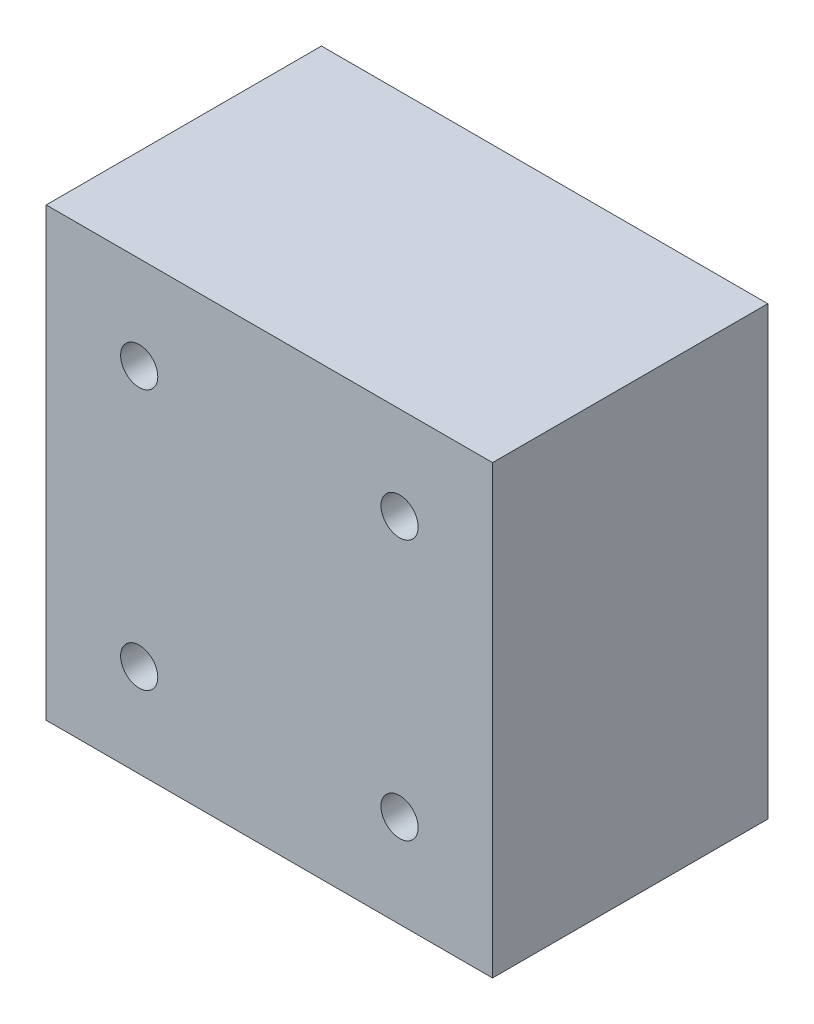
ISO-10303-21;
HEADER;
FILE_DESCRIPTION(('STEP AP214'),'2;1');
FILE_NAME('part.step','',(''),(''),'','','');
FILE_SCHEMA(('AUTOMOTIVE_DESIGN { 1 0 10303 214 1 1 1 1 }'));
ENDSEC;
DATA;
#1=APPLICATION_CONTEXT('core data for automotive mechanical design processes');
#2=APPLICATION_PROTOCOL_DEFINITION('international standard','automotive_design',2000,#1);
#3=PRODUCT_CONTEXT('',#1,'mechanical');
#4=PRODUCT('Part','Part','',(#3));
#5=PRODUCT_RELATED_PRODUCT_CATEGORY('part','',(#4));
#6=PRODUCT_DEFINITION_FORMATION('','',#4);
#7=PRODUCT_DEFINITION_CONTEXT('part definition',#1,'design');
#8=PRODUCT_DEFINITION('design','',#6,#7);
#9=PRODUCT_DEFINITION_SHAPE('','',#8);
#10=(LENGTH_UNIT() NAMED_UNIT(*) SI_UNIT(.MILLI.,.METRE.));
#11=(NAMED_UNIT(*) PLANE_ANGLE_UNIT() SI_UNIT($,.RADIAN.));
#12=(NAMED_UNIT(*) SI_UNIT($,.STERADIAN.) SOLID_ANGLE_UNIT());
#13=UNCERTAINTY_MEASURE_WITH_UNIT(LENGTH_MEASURE(1.E-05),#10,'distance_accuracy_value','');
#14=(GEOMETRIC_REPRESENTATION_CONTEXT(3) GLOBAL_UNCERTAINTY_ASSIGNED_CONTEXT((#13)) GLOBAL_UNIT_ASSIGNED_CONTEXT((#10,
#11,#12)) REPRESENTATION_CONTEXT('',''));
#15=CARTESIAN_POINT('',(0.,0.,0.));
#16=DIRECTION('',(0.,0.,1.));
#17=DIRECTION('',(1.,0.,0.));
#18=AXIS2_PLACEMENT_3D('',#15,#16,#17);
#19=CARTESIAN_POINT('',(30.,30.,37.));
#20=DIRECTION('',(-1.,0.,0.));
#21=DIRECTION('',(0.,-1.,0.));
#22=AXIS2_PLACEMENT_3D('',#19,#20,#21);
#23=PLANE('',#22);
#24=DIRECTION('',(0.,1.,0.));
#25=VECTOR('',#24,1.);
#26=CARTESIAN_POINT('',(30.,30.,0.));
#27=LINE('',#26,#25);
#28=CARTESIAN_POINT('',(30.,-30.,0.));
#29=VERTEX_POINT('',#28);
#30=CARTESIAN_POINT('',(30.,30.,0.));
#31=VERTEX_POINT('',#30);
#32=EDGE_CURVE('E113',#29,#31,#27,.T.);
#33=ORIENTED_EDGE('',*,*,#32,.T.);
#34=DIRECTION('',(0.,0.,-1.));
#35=VECTOR('',#34,1.);
#36=CARTESIAN_POINT('',(30.,30.,37.));
#37=LINE('',#36,#35);
#38=CARTESIAN_POINT('',(30.,30.,37.));
#39=VERTEX_POINT('',#38);
#40=EDGE_CURVE('E11',#39,#31,#37,.T.);
#41=ORIENTED_EDGE('',*,*,#40,.F.);
#42=DIRECTION('',(0.,1.,0.));
#43=VECTOR('',#42,1.);
#44=CARTESIAN_POINT('',(30.,30.,37.));
#45=LINE('',#44,#43);
#46=CARTESIAN_POINT('',(30.,-30.,37.));
#47=VERTEX_POINT('',#46);
#48=EDGE_CURVE('E96',#47,#39,#45,.T.);
#49=ORIENTED_EDGE('',*,*,#48,.F.);
#50=DIRECTION('',(0.,0.,-1.));
#51=VECTOR('',#50,1.);
#52=CARTESIAN_POINT('',(30.,-30.,37.));
#53=LINE('',#52,#51);
#54=EDGE_CURVE('E109',#47,#29,#53,.T.);
#55=ORIENTED_EDGE('',*,*,#54,.T.);
#56=EDGE_LOOP('',(#33,#41,#49,#55));
#57=FACE_BOUND('',#56,.T.);
#58=ADVANCED_FACE('F42',(#57),#23,.F.);
#59=CARTESIAN_POINT('',(-30.,30.,37.));
#60=DIRECTION('',(0.,-1.,0.));
#61=DIRECTION('',(0.,0.,-1.));
#62=AXIS2_PLACEMENT_3D('',#59,#60,#61);
#63=PLANE('',#62);
#64=DIRECTION('',(-1.,0.,0.));
#65=VECTOR('',#64,1.);
#66=CARTESIAN_POINT('',(-30.,30.,0.));
#67=LINE('',#66,#65);
#68=CARTESIAN_POINT('',(-30.,30.,0.));
#69=VERTEX_POINT('',#68);
#70=EDGE_CURVE('E101',#31,#69,#67,.T.);
#71=ORIENTED_EDGE('',*,*,#70,.T.);
#72=DIRECTION('',(0.,0.,-1.));
#73=VECTOR('',#72,1.);
#74=CARTESIAN_POINT('',(-30.,30.,37.));
#75=LINE('',#74,#73);
#76=CARTESIAN_POINT('',(-30.,30.,37.));
#77=VERTEX_POINT('',#76);
#78=EDGE_CURVE('E52',#77,#69,#75,.T.);
#79=ORIENTED_EDGE('',*,*,#78,.F.);
#80=DIRECTION('',(-1.,0.,0.));
#81=VECTOR('',#80,1.);
#82=CARTESIAN_POINT('',(-30.,30.,37.));
#83=LINE('',#82,#81);
#84=EDGE_CURVE('E91',#39,#77,#83,.T.);
#85=ORIENTED_EDGE('',*,*,#84,.F.);
#86=ORIENTED_EDGE('',*,*,#40,.T.);
#87=EDGE_LOOP('',(#71,#79,#85,#86));
#88=FACE_BOUND('',#87,.T.);
#89=ADVANCED_FACE('F100',(#88),#63,.F.);
#90=CARTESIAN_POINT('',(-30.,30.,37.));
#91=DIRECTION('',(1.,0.,0.));
#92=DIRECTION('',(0.,1.,0.));
#93=AXIS2_PLACEMENT_3D('',#90,#91,#92);
#94=PLANE('',#93);
#95=DIRECTION('',(0.,-1.,0.));
#96=VECTOR('',#95,1.);
#97=CARTESIAN_POINT('',(-30.,30.,0.));
#98=LINE('',#97,#96);
#99=CARTESIAN_POINT('',(-30.,-30.,0.));
#100=VERTEX_POINT('',#99);
#101=EDGE_CURVE('E78',#69,#100,#98,.T.);
#102=ORIENTED_EDGE('',*,*,#101,.T.);
#103=DIRECTION('',(0.,0.,-1.));
#104=VECTOR('',#103,1.);
#105=CARTESIAN_POINT('',(-30.,-30.,37.));
#106=LINE('',#105,#104);
#107=CARTESIAN_POINT('',(-30.,-30.,37.));
#108=VERTEX_POINT('',#107);
#109=EDGE_CURVE('E103',#108,#100,#106,.T.);
#110=ORIENTED_EDGE('',*,*,#109,.F.);
#111=DIRECTION('',(0.,-1.,0.));
#112=VECTOR('',#111,1.);
#113=CARTESIAN_POINT('',(-30.,30.,37.));
#114=LINE('',#113,#112);
#115=EDGE_CURVE('E94',#77,#108,#114,.T.);
#116=ORIENTED_EDGE('',*,*,#115,.F.);
#117=ORIENTED_EDGE('',*,*,#78,.T.);
#118=EDGE_LOOP('',(#102,#110,#116,#117));
#119=FACE_BOUND('',#118,.T.);
#120=ADVANCED_FACE('F105',(#119),#94,.F.);
#121=CARTESIAN_POINT('',(-30.,-30.,37.));
#122=DIRECTION('',(0.,1.,0.));
#123=DIRECTION('',(0.,0.,1.));
#124=AXIS2_PLACEMENT_3D('',#121,#122,#123);
#125=PLANE('',#124);
#126=DIRECTION('',(1.,0.,0.));
#127=VECTOR('',#126,1.);
#128=CARTESIAN_POINT('',(-30.,-30.,0.));
#129=LINE('',#128,#127);
#130=EDGE_CURVE('E84',#100,#29,#129,.T.);
#131=ORIENTED_EDGE('',*,*,#130,.T.);
#132=ORIENTED_EDGE('',*,*,#54,.F.);
#133=DIRECTION('',(1.,0.,0.));
#134=VECTOR('',#133,1.);
#135=CARTESIAN_POINT('',(-30.,-30.,37.));
#136=LINE('',#135,#134);
#137=EDGE_CURVE('E61',#108,#47,#136,.T.);
#138=ORIENTED_EDGE('',*,*,#137,.F.);
#139=ORIENTED_EDGE('',*,*,#109,.T.);
#140=EDGE_LOOP('',(#131,#132,#138,#139));
#141=FACE_BOUND('',#140,.T.);
#142=ADVANCED_FACE('F174',(#141),#125,.F.);
#143=CARTESIAN_POINT('',(0.,0.,37.));
#144=DIRECTION('',(0.,0.,1.));
#145=DIRECTION('',(1.,0.,0.));
#146=AXIS2_PLACEMENT_3D('',#143,#144,#145);
#147=PLANE('',#146);
#148=CARTESIAN_POINT('',(-17.5,-17.5,37.));
#149=DIRECTION('',(0.,0.,1.));
#150=DIRECTION('',(1.,0.,0.));
#151=AXIS2_PLACEMENT_3D('',#148,#149,#150);
#152=CIRCLE('',#151,2.5);
#153=CARTESIAN_POINT('',(-15.,-17.5,37.));
#154=VERTEX_POINT('',#153);
#155=EDGE_CURVE('E276',#154,#154,#152,.T.);
#156=ORIENTED_EDGE('',*,*,#155,.F.);
#157=EDGE_LOOP('',(#156));
#158=FACE_BOUND('',#157,.T.);
#159=CARTESIAN_POINT('',(17.5,-17.5,37.));
#160=DIRECTION('',(0.,0.,1.));
#161=DIRECTION('',(1.,0.,0.));
#162=AXIS2_PLACEMENT_3D('',#159,#160,#161);
#163=CIRCLE('',#162,2.5);
#164=CARTESIAN_POINT('',(20.,-17.5,37.));
#165=VERTEX_POINT('',#164);
#166=EDGE_CURVE('E269',#165,#165,#163,.T.);
#167=ORIENTED_EDGE('',*,*,#166,.F.);
#168=EDGE_LOOP('',(#167));
#169=FACE_BOUND('',#168,.T.);
#170=CARTESIAN_POINT('',(17.5,17.5,37.));
#171=DIRECTION('',(0.,0.,1.));
#172=DIRECTION('',(1.,0.,0.));
#173=AXIS2_PLACEMENT_3D('',#170,#171,#172);
#174=CIRCLE('',#173,2.5);
#175=CARTESIAN_POINT('',(20.,17.5,37.));
#176=VERTEX_POINT('',#175);
#177=EDGE_CURVE('E261',#176,#176,#174,.T.);
#178=ORIENTED_EDGE('',*,*,#177,.F.);
#179=EDGE_LOOP('',(#178));
#180=FACE_BOUND('',#179,.T.);
#181=CARTESIAN_POINT('',(-17.5,17.5,37.));
#182=DIRECTION('',(0.,0.,1.));
#183=DIRECTION('',(1.,0.,0.));
#184=AXIS2_PLACEMENT_3D('',#181,#182,#183);
#185=CIRCLE('',#184,2.5);
#186=CARTESIAN_POINT('',(-15.,17.5,37.));
#187=VERTEX_POINT('',#186);
#188=EDGE_CURVE('E132',#187,#187,#185,.T.);
#189=ORIENTED_EDGE('',*,*,#188,.F.);
#190=EDGE_LOOP('',(#189));
#191=FACE_BOUND('',#190,.T.);
#192=ORIENTED_EDGE('',*,*,#48,.T.);
#193=ORIENTED_EDGE('',*,*,#84,.T.);
#194=ORIENTED_EDGE('',*,*,#115,.T.);
#195=ORIENTED_EDGE('',*,*,#137,.T.);
#196=EDGE_LOOP('',(#192,#193,#194,#195));
#197=FACE_BOUND('',#196,.T.);
#198=ADVANCED_FACE('F92',(#158,#169,#180,#191,#197),#147,.T.);
#199=CARTESIAN_POINT('',(0.,0.,0.));
#200=DIRECTION('',(0.,0.,1.));
#201=DIRECTION('',(1.,0.,0.));
#202=AXIS2_PLACEMENT_3D('',#199,#200,#201);
#203=PLANE('',#202);
#204=CARTESIAN_POINT('',(-17.5,-17.5,0.));
#205=DIRECTION('',(0.,0.,1.));
#206=DIRECTION('',(1.,0.,0.));
#207=AXIS2_PLACEMENT_3D('',#204,#205,#206);
#208=CIRCLE('',#207,2.5);
#209=CARTESIAN_POINT('',(-15.,-17.5,0.));
#210=VERTEX_POINT('',#209);
#211=EDGE_CURVE('E45',#210,#210,#208,.T.);
#212=ORIENTED_EDGE('',*,*,#211,.T.);
#213=EDGE_LOOP('',(#212));
#214=FACE_BOUND('',#213,.T.);
#215=CARTESIAN_POINT('',(17.5,-17.5,0.));
#216=DIRECTION('',(0.,0.,1.));
#217=DIRECTION('',(1.,0.,0.));
#218=AXIS2_PLACEMENT_3D('',#215,#216,#217);
#219=CIRCLE('',#218,2.5);
#220=CARTESIAN_POINT('',(20.,-17.5,0.));
#221=VERTEX_POINT('',#220);
#222=EDGE_CURVE('E135',#221,#221,#219,.T.);
#223=ORIENTED_EDGE('',*,*,#222,.T.);
#224=EDGE_LOOP('',(#223));
#225=FACE_BOUND('',#224,.T.);
#226=CARTESIAN_POINT('',(17.5,17.5,0.));
#227=DIRECTION('',(0.,0.,1.));
#228=DIRECTION('',(1.,0.,0.));
#229=AXIS2_PLACEMENT_3D('',#226,#227,#228);
#230=CIRCLE('',#229,2.5);
#231=CARTESIAN_POINT('',(20.,17.5,0.));
#232=VERTEX_POINT('',#231);
#233=EDGE_CURVE('E131',#232,#232,#230,.T.);
#234=ORIENTED_EDGE('',*,*,#233,.T.);
#235=EDGE_LOOP('',(#234));
#236=FACE_BOUND('',#235,.T.);
#237=CARTESIAN_POINT('',(-17.5,17.5,0.));
#238=DIRECTION('',(0.,0.,1.));
#239=DIRECTION('',(1.,0.,0.));
#240=AXIS2_PLACEMENT_3D('',#237,#238,#239);
#241=CIRCLE('',#240,2.5);
#242=CARTESIAN_POINT('',(-15.,17.5,0.));
#243=VERTEX_POINT('',#242);
#244=EDGE_CURVE('E127',#243,#243,#241,.T.);
#245=ORIENTED_EDGE('',*,*,#244,.T.);
#246=EDGE_LOOP('',(#245));
#247=FACE_BOUND('',#246,.T.);
#248=ORIENTED_EDGE('',*,*,#32,.F.);
#249=ORIENTED_EDGE('',*,*,#130,.F.);
#250=ORIENTED_EDGE('',*,*,#101,.F.);
#251=ORIENTED_EDGE('',*,*,#70,.F.);
#252=EDGE_LOOP('',(#248,#249,#250,#251));
#253=FACE_BOUND('',#252,.T.);
#254=ADVANCED_FACE('F144',(#214,#225,#236,#247,#253),#203,.F.);
#255=CARTESIAN_POINT('',(-17.5,17.5,-23.));
#256=DIRECTION('',(0.,0.,1.));
#257=DIRECTION('',(1.,0.,0.));
#258=AXIS2_PLACEMENT_3D('',#255,#256,#257);
#259=CYLINDRICAL_SURFACE('',#258,2.5);
#260=ORIENTED_EDGE('',*,*,#188,.T.);
#261=EDGE_LOOP('',(#260));
#262=FACE_BOUND('',#261,.T.);
#263=ORIENTED_EDGE('',*,*,#244,.F.);
#264=EDGE_LOOP('',(#263));
#265=FACE_BOUND('',#264,.T.);
#266=ADVANCED_FACE('F167',(#262,#265),#259,.F.);
#267=CARTESIAN_POINT('',(17.5,17.5,-23.));
#268=DIRECTION('',(0.,0.,1.));
#269=DIRECTION('',(1.,0.,0.));
#270=AXIS2_PLACEMENT_3D('',#267,#268,#269);
#271=CYLINDRICAL_SURFACE('',#270,2.5);
#272=ORIENTED_EDGE('',*,*,#177,.T.);
#273=EDGE_LOOP('',(#272));
#274=FACE_BOUND('',#273,.T.);
#275=ORIENTED_EDGE('',*,*,#233,.F.);
#276=EDGE_LOOP('',(#275));
#277=FACE_BOUND('',#276,.T.);
#278=ADVANCED_FACE('F154',(#274,#277),#271,.F.);
#279=CARTESIAN_POINT('',(17.5,-17.5,-23.));
#280=DIRECTION('',(0.,0.,1.));
#281=DIRECTION('',(1.,0.,0.));
#282=AXIS2_PLACEMENT_3D('',#279,#280,#281);
#283=CYLINDRICAL_SURFACE('',#282,2.5);
#284=ORIENTED_EDGE('',*,*,#166,.T.);
#285=EDGE_LOOP('',(#284));
#286=FACE_BOUND('',#285,.T.);
#287=ORIENTED_EDGE('',*,*,#222,.F.);
#288=EDGE_LOOP('',(#287));
#289=FACE_BOUND('',#288,.T.);
#290=ADVANCED_FACE('F148',(#286,#289),#283,.F.);
#291=CARTESIAN_POINT('',(-17.5,-17.5,-23.));
#292=DIRECTION('',(0.,0.,1.));
#293=DIRECTION('',(1.,0.,0.));
#294=AXIS2_PLACEMENT_3D('',#291,#292,#293);
#295=CYLINDRICAL_SURFACE('',#294,2.5);
#296=ORIENTED_EDGE('',*,*,#155,.T.);
#297=EDGE_LOOP('',(#296));
#298=FACE_BOUND('',#297,.T.);
#299=ORIENTED_EDGE('',*,*,#211,.F.);
#300=EDGE_LOOP('',(#299));
#301=FACE_BOUND('',#300,.T.);
#302=ADVANCED_FACE('F146',(#298,#301),#295,.F.);
#303=CLOSED_SHELL('',(#58,#89,#120,#142,#198,#254,#266,#278,#290,#302));
#304=MANIFOLD_SOLID_BREP('B2',#303);
#305=ADVANCED_BREP_SHAPE_REPRESENTATION('',(#18,#304),#14);
#306=SHAPE_DEFINITION_REPRESENTATION(#9,#305);
ENDSEC;
END-ISO-10303-21;
